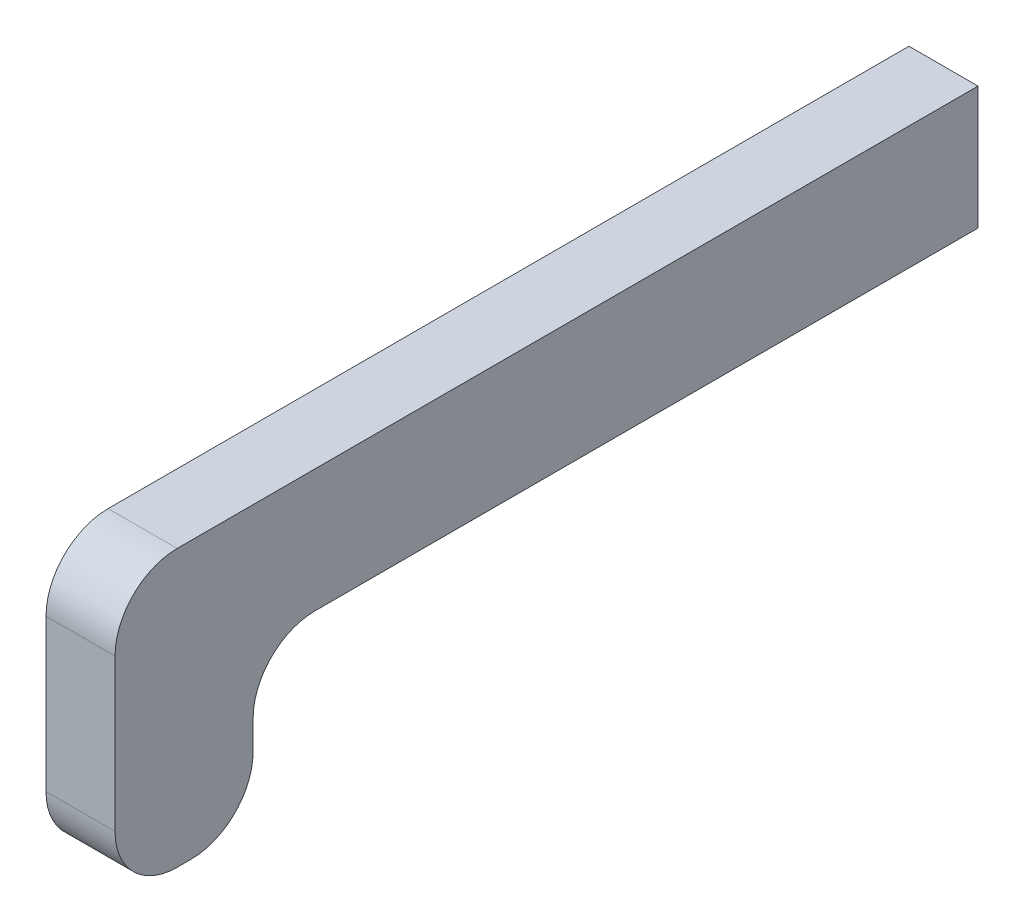
ISO-10303-21;
HEADER;
FILE_DESCRIPTION(('STEP AP214'),'2;1');
FILE_NAME('part.step','',(''),(''),'','','');
FILE_SCHEMA(('AUTOMOTIVE_DESIGN { 1 0 10303 214 1 1 1 1 }'));
ENDSEC;
DATA;
#1=APPLICATION_CONTEXT('core data for automotive mechanical design processes');
#2=APPLICATION_PROTOCOL_DEFINITION('international standard','automotive_design',2000,#1);
#3=PRODUCT_CONTEXT('',#1,'mechanical');
#4=PRODUCT('Part','Part','',(#3));
#5=PRODUCT_RELATED_PRODUCT_CATEGORY('part','',(#4));
#6=PRODUCT_DEFINITION_FORMATION('','',#4);
#7=PRODUCT_DEFINITION_CONTEXT('part definition',#1,'design');
#8=PRODUCT_DEFINITION('design','',#6,#7);
#9=PRODUCT_DEFINITION_SHAPE('','',#8);
#10=(LENGTH_UNIT() NAMED_UNIT(*) SI_UNIT(.MILLI.,.METRE.));
#11=(NAMED_UNIT(*) PLANE_ANGLE_UNIT() SI_UNIT($,.RADIAN.));
#12=(NAMED_UNIT(*) SI_UNIT($,.STERADIAN.) SOLID_ANGLE_UNIT());
#13=UNCERTAINTY_MEASURE_WITH_UNIT(LENGTH_MEASURE(1.E-05),#10,'distance_accuracy_value','');
#14=(GEOMETRIC_REPRESENTATION_CONTEXT(3) GLOBAL_UNCERTAINTY_ASSIGNED_CONTEXT((#13)) GLOBAL_UNIT_ASSIGNED_CONTEXT((#10,
#11,#12)) REPRESENTATION_CONTEXT('',''));
#15=CARTESIAN_POINT('',(0.,0.,0.));
#16=DIRECTION('',(0.,0.,1.));
#17=DIRECTION('',(1.,0.,0.));
#18=AXIS2_PLACEMENT_3D('',#15,#16,#17);
#19=CARTESIAN_POINT('',(105.7,-33.,0.));
#20=DIRECTION('',(-1.,0.,0.));
#21=DIRECTION('',(0.,-1.,0.));
#22=AXIS2_PLACEMENT_3D('',#19,#20,#21);
#23=PLANE('',#22);
#24=DIRECTION('',(0.,0.,-1.));
#25=VECTOR('',#24,1.);
#26=CARTESIAN_POINT('',(105.7,-10.8133393863734,0.));
#27=LINE('',#26,#25);
#28=CARTESIAN_POINT('',(105.7,-10.8133393863734,95.9999999999999));
#29=VERTEX_POINT('',#28);
#30=CARTESIAN_POINT('',(105.7,-10.8133393863734,0.));
#31=VERTEX_POINT('',#30);
#32=EDGE_CURVE('E116',#29,#31,#27,.T.);
#33=ORIENTED_EDGE('',*,*,#32,.F.);
#34=CARTESIAN_POINT('',(105.7,-19.8133393863734,96.));
#35=DIRECTION('',(-1.,0.,0.));
#36=DIRECTION('',(0.,1.,0.));
#37=AXIS2_PLACEMENT_3D('',#34,#35,#36);
#38=CIRCLE('',#37,9.);
#39=CARTESIAN_POINT('',(105.7,-19.8133393863735,105.));
#40=VERTEX_POINT('',#39);
#41=EDGE_CURVE('E169',#40,#29,#38,.T.);
#42=ORIENTED_EDGE('',*,*,#41,.F.);
#43=DIRECTION('',(0.,1.,0.));
#44=VECTOR('',#43,1.);
#45=CARTESIAN_POINT('',(105.7,-19.8133393863735,105.));
#46=LINE('',#45,#44);
#47=CARTESIAN_POINT('',(105.7,-23.9999999999999,105.));
#48=VERTEX_POINT('',#47);
#49=EDGE_CURVE('E162',#48,#40,#46,.T.);
#50=ORIENTED_EDGE('',*,*,#49,.F.);
#51=CARTESIAN_POINT('',(105.7,-24.,114.));
#52=DIRECTION('',(1.,0.,0.));
#53=DIRECTION('',(0.,-1.,0.));
#54=AXIS2_PLACEMENT_3D('',#51,#52,#53);
#55=CIRCLE('',#54,8.99999999999999);
#56=CARTESIAN_POINT('',(105.7,-33.,114.));
#57=VERTEX_POINT('',#56);
#58=EDGE_CURVE('E159',#57,#48,#55,.T.);
#59=ORIENTED_EDGE('',*,*,#58,.F.);
#60=DIRECTION('',(0.,0.,-1.));
#61=VECTOR('',#60,1.);
#62=CARTESIAN_POINT('',(105.7,-33.,5.));
#63=LINE('',#62,#61);
#64=CARTESIAN_POINT('',(105.7,-33.,116.));
#65=VERTEX_POINT('',#64);
#66=EDGE_CURVE('E133',#65,#57,#63,.T.);
#67=ORIENTED_EDGE('',*,*,#66,.F.);
#68=CARTESIAN_POINT('',(105.7,-24.,116.));
#69=DIRECTION('',(1.,0.,0.));
#70=DIRECTION('',(0.,-1.,0.));
#71=AXIS2_PLACEMENT_3D('',#68,#69,#70);
#72=CIRCLE('',#71,8.99999999999999);
#73=CARTESIAN_POINT('',(105.7,-23.9999999999999,125.));
#74=VERTEX_POINT('',#73);
#75=EDGE_CURVE('E156',#74,#65,#72,.T.);
#76=ORIENTED_EDGE('',*,*,#75,.F.);
#77=DIRECTION('',(0.,-1.,0.));
#78=VECTOR('',#77,1.);
#79=CARTESIAN_POINT('',(105.7,7.00000000000001,125.));
#80=LINE('',#79,#78);
#81=CARTESIAN_POINT('',(105.7,-1.99999999999998,125.));
#82=VERTEX_POINT('',#81);
#83=EDGE_CURVE('E41',#82,#74,#80,.T.);
#84=ORIENTED_EDGE('',*,*,#83,.F.);
#85=CARTESIAN_POINT('',(105.7,-1.99999999999998,116.));
#86=DIRECTION('',(1.,0.,0.));
#87=DIRECTION('',(0.,-1.,0.));
#88=AXIS2_PLACEMENT_3D('',#85,#86,#87);
#89=CIRCLE('',#88,9.);
#90=CARTESIAN_POINT('',(105.7,7.00000000000001,116.));
#91=VERTEX_POINT('',#90);
#92=EDGE_CURVE('E48',#91,#82,#89,.T.);
#93=ORIENTED_EDGE('',*,*,#92,.F.);
#94=DIRECTION('',(0.,0.,-1.));
#95=VECTOR('',#94,1.);
#96=CARTESIAN_POINT('',(105.7,7.00000000000001,125.));
#97=LINE('',#96,#95);
#98=CARTESIAN_POINT('',(105.7,7.00000000000001,0.));
#99=VERTEX_POINT('',#98);
#100=EDGE_CURVE('E124',#91,#99,#97,.T.);
#101=ORIENTED_EDGE('',*,*,#100,.T.);
#102=DIRECTION('',(0.,-1.,0.));
#103=VECTOR('',#102,1.);
#104=CARTESIAN_POINT('',(105.7,-33.,0.));
#105=LINE('',#104,#103);
#106=EDGE_CURVE('E137',#99,#31,#105,.T.);
#107=ORIENTED_EDGE('',*,*,#106,.T.);
#108=EDGE_LOOP('',(#33,#42,#50,#59,#67,#76,#84,#93,#101,#107));
#109=FACE_BOUND('',#108,.T.);
#110=ADVANCED_FACE('F32',(#109),#23,.T.);
#111=CARTESIAN_POINT('',(103.85,-2.5,0.));
#112=DIRECTION('',(0.,0.,1.));
#113=DIRECTION('',(1.,0.,0.));
#114=AXIS2_PLACEMENT_3D('',#111,#112,#113);
#115=PLANE('',#114);
#116=DIRECTION('',(0.,1.,0.));
#117=VECTOR('',#116,1.);
#118=CARTESIAN_POINT('',(115.7,7.00000000000001,0.));
#119=LINE('',#118,#117);
#120=CARTESIAN_POINT('',(115.7,-10.8133393863734,0.));
#121=VERTEX_POINT('',#120);
#122=CARTESIAN_POINT('',(115.7,7.00000000000001,0.));
#123=VERTEX_POINT('',#122);
#124=EDGE_CURVE('E131',#121,#123,#119,.T.);
#125=ORIENTED_EDGE('',*,*,#124,.F.);
#126=DIRECTION('',(-1.,0.,0.));
#127=VECTOR('',#126,1.);
#128=CARTESIAN_POINT('',(115.7,-10.8133393863734,0.));
#129=LINE('',#128,#127);
#130=EDGE_CURVE('E140',#121,#31,#129,.T.);
#131=ORIENTED_EDGE('',*,*,#130,.T.);
#132=ORIENTED_EDGE('',*,*,#106,.F.);
#133=DIRECTION('',(-1.,0.,0.));
#134=VECTOR('',#133,1.);
#135=CARTESIAN_POINT('',(105.7,7.00000000000001,0.));
#136=LINE('',#135,#134);
#137=EDGE_CURVE('E36',#123,#99,#136,.T.);
#138=ORIENTED_EDGE('',*,*,#137,.F.);
#139=EDGE_LOOP('',(#125,#131,#132,#138));
#140=FACE_BOUND('',#139,.T.);
#141=ADVANCED_FACE('F34',(#140),#115,.F.);
#142=CARTESIAN_POINT('',(115.7,-24.,114.));
#143=DIRECTION('',(-1.,0.,0.));
#144=DIRECTION('',(0.,-1.,0.));
#145=AXIS2_PLACEMENT_3D('',#142,#143,#144);
#146=CYLINDRICAL_SURFACE('',#145,8.99999999999999);
#147=ORIENTED_EDGE('',*,*,#58,.T.);
#148=DIRECTION('',(-1.,0.,0.));
#149=VECTOR('',#148,1.);
#150=CARTESIAN_POINT('',(115.7,-23.9999999999999,105.));
#151=LINE('',#150,#149);
#152=CARTESIAN_POINT('',(115.7,-23.9999999999999,105.));
#153=VERTEX_POINT('',#152);
#154=EDGE_CURVE('E179',#153,#48,#151,.T.);
#155=ORIENTED_EDGE('',*,*,#154,.F.);
#156=CARTESIAN_POINT('',(115.7,-24.,114.));
#157=DIRECTION('',(1.,0.,0.));
#158=DIRECTION('',(0.,-1.,0.));
#159=AXIS2_PLACEMENT_3D('',#156,#157,#158);
#160=CIRCLE('',#159,8.99999999999999);
#161=CARTESIAN_POINT('',(115.7,-33.,114.));
#162=VERTEX_POINT('',#161);
#163=EDGE_CURVE('E224',#162,#153,#160,.T.);
#164=ORIENTED_EDGE('',*,*,#163,.F.);
#165=DIRECTION('',(-1.,0.,0.));
#166=VECTOR('',#165,1.);
#167=CARTESIAN_POINT('',(115.7,-33.,114.));
#168=LINE('',#167,#166);
#169=EDGE_CURVE('E181',#162,#57,#168,.T.);
#170=ORIENTED_EDGE('',*,*,#169,.T.);
#171=EDGE_LOOP('',(#147,#155,#164,#170));
#172=FACE_BOUND('',#171,.T.);
#173=ADVANCED_FACE('F200',(#172),#146,.T.);
#174=CARTESIAN_POINT('',(115.7,-19.8133393863735,105.));
#175=DIRECTION('',(0.,0.,1.));
#176=DIRECTION('',(1.,0.,0.));
#177=AXIS2_PLACEMENT_3D('',#174,#175,#176);
#178=PLANE('',#177);
#179=ORIENTED_EDGE('',*,*,#49,.T.);
#180=DIRECTION('',(-1.,0.,0.));
#181=VECTOR('',#180,1.);
#182=CARTESIAN_POINT('',(115.7,-19.8133393863735,105.));
#183=LINE('',#182,#181);
#184=CARTESIAN_POINT('',(115.7,-19.8133393863735,105.));
#185=VERTEX_POINT('',#184);
#186=EDGE_CURVE('E177',#185,#40,#183,.T.);
#187=ORIENTED_EDGE('',*,*,#186,.F.);
#188=DIRECTION('',(0.,1.,0.));
#189=VECTOR('',#188,1.);
#190=CARTESIAN_POINT('',(115.7,-19.8133393863735,105.));
#191=LINE('',#190,#189);
#192=EDGE_CURVE('E226',#153,#185,#191,.T.);
#193=ORIENTED_EDGE('',*,*,#192,.F.);
#194=ORIENTED_EDGE('',*,*,#154,.T.);
#195=EDGE_LOOP('',(#179,#187,#193,#194));
#196=FACE_BOUND('',#195,.T.);
#197=ADVANCED_FACE('F206',(#196),#178,.F.);
#198=CARTESIAN_POINT('',(105.7,7.00000000000001,5.));
#199=DIRECTION('',(0.,-1.,0.));
#200=DIRECTION('',(1.,0.,0.));
#201=AXIS2_PLACEMENT_3D('',#198,#199,#200);
#202=PLANE('',#201);
#203=ORIENTED_EDGE('',*,*,#137,.T.);
#204=ORIENTED_EDGE('',*,*,#100,.F.);
#205=DIRECTION('',(-1.,0.,0.));
#206=VECTOR('',#205,1.);
#207=CARTESIAN_POINT('',(115.7,7.00000000000001,116.));
#208=LINE('',#207,#206);
#209=CARTESIAN_POINT('',(115.7,7.00000000000001,116.));
#210=VERTEX_POINT('',#209);
#211=EDGE_CURVE('E111',#210,#91,#208,.T.);
#212=ORIENTED_EDGE('',*,*,#211,.F.);
#213=DIRECTION('',(0.,0.,-1.));
#214=VECTOR('',#213,1.);
#215=CARTESIAN_POINT('',(115.7,7.00000000000001,5.));
#216=LINE('',#215,#214);
#217=EDGE_CURVE('E122',#210,#123,#216,.T.);
#218=ORIENTED_EDGE('',*,*,#217,.T.);
#219=EDGE_LOOP('',(#203,#204,#212,#218));
#220=FACE_BOUND('',#219,.T.);
#221=ADVANCED_FACE('F121',(#220),#202,.F.);
#222=CARTESIAN_POINT('',(0.,0.,125.));
#223=DIRECTION('',(0.,0.,-1.));
#224=DIRECTION('',(-1.,0.,0.));
#225=AXIS2_PLACEMENT_3D('',#222,#223,#224);
#226=PLANE('',#225);
#227=ORIENTED_EDGE('',*,*,#83,.T.);
#228=DIRECTION('',(-1.,0.,0.));
#229=VECTOR('',#228,1.);
#230=CARTESIAN_POINT('',(115.7,-23.9999999999999,125.));
#231=LINE('',#230,#229);
#232=CARTESIAN_POINT('',(115.7,-24.,125.));
#233=VERTEX_POINT('',#232);
#234=EDGE_CURVE('E151',#233,#74,#231,.T.);
#235=ORIENTED_EDGE('',*,*,#234,.F.);
#236=DIRECTION('',(0.,1.,0.));
#237=VECTOR('',#236,1.);
#238=CARTESIAN_POINT('',(115.7,7.00000000000001,125.));
#239=LINE('',#238,#237);
#240=CARTESIAN_POINT('',(115.7,-2.00000000000005,125.));
#241=VERTEX_POINT('',#240);
#242=EDGE_CURVE('E11',#233,#241,#239,.T.);
#243=ORIENTED_EDGE('',*,*,#242,.T.);
#244=DIRECTION('',(-1.,0.,0.));
#245=VECTOR('',#244,1.);
#246=CARTESIAN_POINT('',(115.7,-2.00000000000005,125.));
#247=LINE('',#246,#245);
#248=EDGE_CURVE('E112',#241,#82,#247,.T.);
#249=ORIENTED_EDGE('',*,*,#248,.T.);
#250=EDGE_LOOP('',(#227,#235,#243,#249));
#251=FACE_BOUND('',#250,.T.);
#252=ADVANCED_FACE('F150',(#251),#226,.F.);
#253=CARTESIAN_POINT('',(115.7,7.00000000000001,5.));
#254=DIRECTION('',(-1.,0.,0.));
#255=DIRECTION('',(0.,-1.,0.));
#256=AXIS2_PLACEMENT_3D('',#253,#254,#255);
#257=PLANE('',#256);
#258=CARTESIAN_POINT('',(115.7,-19.8133393863734,96.));
#259=DIRECTION('',(-1.,0.,0.));
#260=DIRECTION('',(0.,1.,0.));
#261=AXIS2_PLACEMENT_3D('',#258,#259,#260);
#262=CIRCLE('',#261,9.);
#263=CARTESIAN_POINT('',(115.7,-10.8133393863734,95.9999999999999));
#264=VERTEX_POINT('',#263);
#265=EDGE_CURVE('E217',#185,#264,#262,.T.);
#266=ORIENTED_EDGE('',*,*,#265,.T.);
#267=DIRECTION('',(0.,0.,-1.));
#268=VECTOR('',#267,1.);
#269=CARTESIAN_POINT('',(115.7,-10.8133393863734,0.));
#270=LINE('',#269,#268);
#271=EDGE_CURVE('E125',#264,#121,#270,.T.);
#272=ORIENTED_EDGE('',*,*,#271,.T.);
#273=ORIENTED_EDGE('',*,*,#124,.T.);
#274=ORIENTED_EDGE('',*,*,#217,.F.);
#275=CARTESIAN_POINT('',(115.7,-1.99999999999999,116.));
#276=DIRECTION('',(1.,0.,0.));
#277=DIRECTION('',(0.,-1.,0.));
#278=AXIS2_PLACEMENT_3D('',#275,#276,#277);
#279=CIRCLE('',#278,9.);
#280=EDGE_CURVE('E108',#210,#241,#279,.T.);
#281=ORIENTED_EDGE('',*,*,#280,.T.);
#282=ORIENTED_EDGE('',*,*,#242,.F.);
#283=CARTESIAN_POINT('',(115.7,-24.,116.));
#284=DIRECTION('',(1.,0.,0.));
#285=DIRECTION('',(0.,-1.,0.));
#286=AXIS2_PLACEMENT_3D('',#283,#284,#285);
#287=CIRCLE('',#286,8.99999999999999);
#288=CARTESIAN_POINT('',(115.7,-33.,116.));
#289=VERTEX_POINT('',#288);
#290=EDGE_CURVE('E56',#233,#289,#287,.T.);
#291=ORIENTED_EDGE('',*,*,#290,.T.);
#292=DIRECTION('',(0.,0.,-1.));
#293=VECTOR('',#292,1.);
#294=CARTESIAN_POINT('',(115.7,-33.,5.));
#295=LINE('',#294,#293);
#296=EDGE_CURVE('E134',#289,#162,#295,.T.);
#297=ORIENTED_EDGE('',*,*,#296,.T.);
#298=ORIENTED_EDGE('',*,*,#163,.T.);
#299=ORIENTED_EDGE('',*,*,#192,.T.);
#300=EDGE_LOOP('',(#266,#272,#273,#274,#281,#282,#291,#297,#298,#299));
#301=FACE_BOUND('',#300,.T.);
#302=ADVANCED_FACE('F128',(#301),#257,.F.);
#303=CARTESIAN_POINT('',(115.7,-33.,5.));
#304=DIRECTION('',(0.,1.,0.));
#305=DIRECTION('',(0.,0.,1.));
#306=AXIS2_PLACEMENT_3D('',#303,#304,#305);
#307=PLANE('',#306);
#308=ORIENTED_EDGE('',*,*,#66,.T.);
#309=ORIENTED_EDGE('',*,*,#169,.F.);
#310=ORIENTED_EDGE('',*,*,#296,.F.);
#311=DIRECTION('',(-1.,0.,0.));
#312=VECTOR('',#311,1.);
#313=CARTESIAN_POINT('',(115.7,-33.,116.));
#314=LINE('',#313,#312);
#315=EDGE_CURVE('E183',#289,#65,#314,.T.);
#316=ORIENTED_EDGE('',*,*,#315,.T.);
#317=EDGE_LOOP('',(#308,#309,#310,#316));
#318=FACE_BOUND('',#317,.T.);
#319=ADVANCED_FACE('F188',(#318),#307,.F.);
#320=CARTESIAN_POINT('',(115.7,-24.,116.));
#321=DIRECTION('',(-1.,0.,0.));
#322=DIRECTION('',(0.,-1.,0.));
#323=AXIS2_PLACEMENT_3D('',#320,#321,#322);
#324=CYLINDRICAL_SURFACE('',#323,8.99999999999999);
#325=ORIENTED_EDGE('',*,*,#75,.T.);
#326=ORIENTED_EDGE('',*,*,#315,.F.);
#327=ORIENTED_EDGE('',*,*,#290,.F.);
#328=ORIENTED_EDGE('',*,*,#234,.T.);
#329=EDGE_LOOP('',(#325,#326,#327,#328));
#330=FACE_BOUND('',#329,.T.);
#331=ADVANCED_FACE('F186',(#330),#324,.T.);
#332=CARTESIAN_POINT('',(115.7,-1.99999999999999,116.));
#333=DIRECTION('',(-1.,0.,0.));
#334=DIRECTION('',(0.,-1.,0.));
#335=AXIS2_PLACEMENT_3D('',#332,#333,#334);
#336=CYLINDRICAL_SURFACE('',#335,9.);
#337=ORIENTED_EDGE('',*,*,#92,.T.);
#338=ORIENTED_EDGE('',*,*,#248,.F.);
#339=ORIENTED_EDGE('',*,*,#280,.F.);
#340=ORIENTED_EDGE('',*,*,#211,.T.);
#341=EDGE_LOOP('',(#337,#338,#339,#340));
#342=FACE_BOUND('',#341,.T.);
#343=ADVANCED_FACE('F110',(#342),#336,.T.);
#344=CARTESIAN_POINT('',(115.7,-10.8133393863734,0.));
#345=DIRECTION('',(0.,1.,0.));
#346=DIRECTION('',(-1.,0.,0.));
#347=AXIS2_PLACEMENT_3D('',#344,#345,#346);
#348=PLANE('',#347);
#349=ORIENTED_EDGE('',*,*,#32,.T.);
#350=ORIENTED_EDGE('',*,*,#130,.F.);
#351=ORIENTED_EDGE('',*,*,#271,.F.);
#352=DIRECTION('',(-1.,0.,0.));
#353=VECTOR('',#352,1.);
#354=CARTESIAN_POINT('',(115.7,-10.8133393863734,95.9999999999999));
#355=LINE('',#354,#353);
#356=EDGE_CURVE('E175',#264,#29,#355,.T.);
#357=ORIENTED_EDGE('',*,*,#356,.T.);
#358=EDGE_LOOP('',(#349,#350,#351,#357));
#359=FACE_BOUND('',#358,.T.);
#360=ADVANCED_FACE('F194',(#359),#348,.F.);
#361=CARTESIAN_POINT('',(115.7,-19.8133393863734,96.));
#362=DIRECTION('',(-1.,0.,0.));
#363=DIRECTION('',(0.,-1.,0.));
#364=AXIS2_PLACEMENT_3D('',#361,#362,#363);
#365=CYLINDRICAL_SURFACE('',#364,9.);
#366=ORIENTED_EDGE('',*,*,#41,.T.);
#367=ORIENTED_EDGE('',*,*,#356,.F.);
#368=ORIENTED_EDGE('',*,*,#265,.F.);
#369=ORIENTED_EDGE('',*,*,#186,.T.);
#370=EDGE_LOOP('',(#366,#367,#368,#369));
#371=FACE_BOUND('',#370,.T.);
#372=ADVANCED_FACE('F209',(#371),#365,.F.);
#373=CLOSED_SHELL('',(#110,#141,#173,#197,#221,#252,#302,#319,#331,#343,#360,#372));
#374=MANIFOLD_SOLID_BREP('B2',#373);
#375=ADVANCED_BREP_SHAPE_REPRESENTATION('',(#18,#374),#14);
#376=SHAPE_DEFINITION_REPRESENTATION(#9,#375);
ENDSEC;
END-ISO-10303-21;
